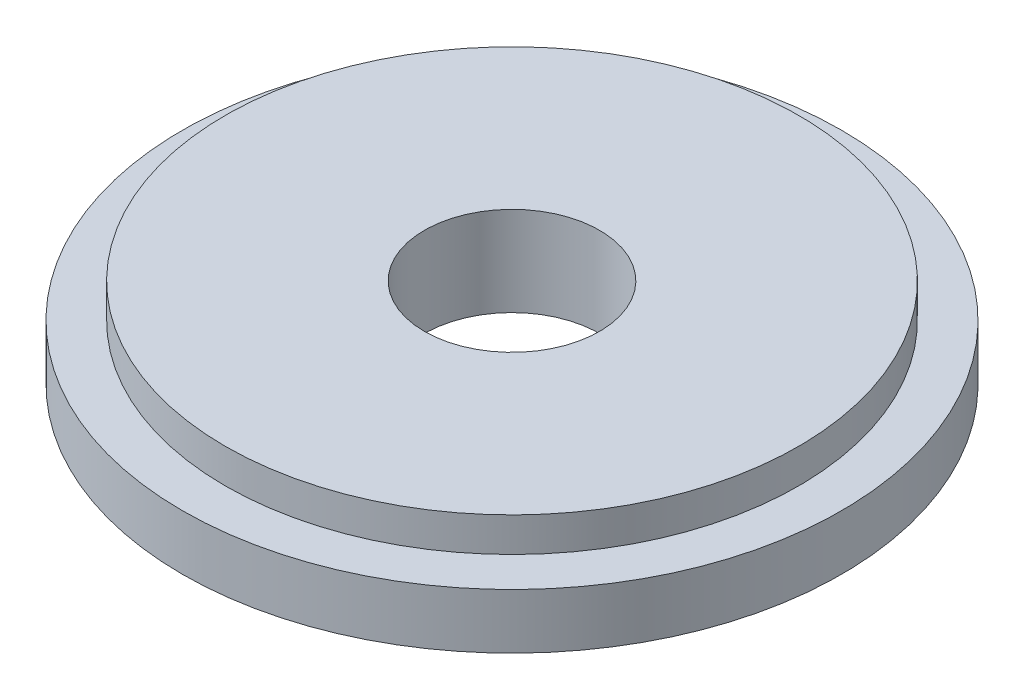
ISO-10303-21;
HEADER;
FILE_DESCRIPTION(('STEP AP214'),'2;1');
FILE_NAME('part.step','',(''),(''),'','','');
FILE_SCHEMA(('AUTOMOTIVE_DESIGN { 1 0 10303 214 1 1 1 1 }'));
ENDSEC;
DATA;
#1=APPLICATION_CONTEXT('core data for automotive mechanical design processes');
#2=APPLICATION_PROTOCOL_DEFINITION('international standard','automotive_design',2000,#1);
#3=PRODUCT_CONTEXT('',#1,'mechanical');
#4=PRODUCT('Part','Part','',(#3));
#5=PRODUCT_RELATED_PRODUCT_CATEGORY('part','',(#4));
#6=PRODUCT_DEFINITION_FORMATION('','',#4);
#7=PRODUCT_DEFINITION_CONTEXT('part definition',#1,'design');
#8=PRODUCT_DEFINITION('design','',#6,#7);
#9=PRODUCT_DEFINITION_SHAPE('','',#8);
#10=(LENGTH_UNIT() NAMED_UNIT(*) SI_UNIT(.MILLI.,.METRE.));
#11=(NAMED_UNIT(*) PLANE_ANGLE_UNIT() SI_UNIT($,.RADIAN.));
#12=(NAMED_UNIT(*) SI_UNIT($,.STERADIAN.) SOLID_ANGLE_UNIT());
#13=UNCERTAINTY_MEASURE_WITH_UNIT(LENGTH_MEASURE(1.E-05),#10,'distance_accuracy_value','');
#14=(GEOMETRIC_REPRESENTATION_CONTEXT(3) GLOBAL_UNCERTAINTY_ASSIGNED_CONTEXT((#13)) GLOBAL_UNIT_ASSIGNED_CONTEXT((#10,
#11,#12)) REPRESENTATION_CONTEXT('',''));
#15=CARTESIAN_POINT('',(0.,0.,0.));
#16=DIRECTION('',(0.,0.,1.));
#17=DIRECTION('',(1.,0.,0.));
#18=AXIS2_PLACEMENT_3D('',#15,#16,#17);
#19=CARTESIAN_POINT('',(0.,1.143,0.));
#20=DIRECTION('',(0.,1.,0.));
#21=DIRECTION('',(0.,0.,1.));
#22=AXIS2_PLACEMENT_3D('',#19,#20,#21);
#23=PLANE('',#22);
#24=CARTESIAN_POINT('',(0.,1.143,0.));
#25=DIRECTION('',(0.,1.,0.));
#26=DIRECTION('',(0.,0.,1.));
#27=AXIS2_PLACEMENT_3D('',#24,#25,#26);
#28=CIRCLE('',#27,6.8326);
#29=CARTESIAN_POINT('',(0.,1.143,6.8326));
#30=VERTEX_POINT('',#29);
#31=EDGE_CURVE('E10',#30,#30,#28,.T.);
#32=ORIENTED_EDGE('',*,*,#31,.T.);
#33=EDGE_LOOP('',(#32));
#34=FACE_BOUND('',#33,.T.);
#35=CARTESIAN_POINT('',(0.,1.143,0.));
#36=DIRECTION('',(0.,1.,0.));
#37=DIRECTION('',(0.,0.,1.));
#38=AXIS2_PLACEMENT_3D('',#35,#36,#37);
#39=CIRCLE('',#38,5.9436);
#40=CARTESIAN_POINT('',(0.,1.143,5.9436));
#41=VERTEX_POINT('',#40);
#42=EDGE_CURVE('E44',#41,#41,#39,.T.);
#43=ORIENTED_EDGE('',*,*,#42,.F.);
#44=EDGE_LOOP('',(#43));
#45=FACE_BOUND('',#44,.T.);
#46=ADVANCED_FACE('F31',(#34,#45),#23,.T.);
#47=CARTESIAN_POINT('',(0.,1.143,0.));
#48=DIRECTION('',(0.,-1.,0.));
#49=DIRECTION('',(0.,0.,-1.));
#50=AXIS2_PLACEMENT_3D('',#47,#48,#49);
#51=CYLINDRICAL_SURFACE('',#50,6.8326);
#52=ORIENTED_EDGE('',*,*,#31,.F.);
#53=EDGE_LOOP('',(#52));
#54=FACE_BOUND('',#53,.T.);
#55=CARTESIAN_POINT('',(0.,0.,0.));
#56=DIRECTION('',(0.,1.,0.));
#57=DIRECTION('',(0.,0.,1.));
#58=AXIS2_PLACEMENT_3D('',#55,#56,#57);
#59=CIRCLE('',#58,6.8326);
#60=CARTESIAN_POINT('',(0.,0.,6.8326));
#61=VERTEX_POINT('',#60);
#62=EDGE_CURVE('E35',#61,#61,#59,.T.);
#63=ORIENTED_EDGE('',*,*,#62,.T.);
#64=EDGE_LOOP('',(#63));
#65=FACE_BOUND('',#64,.T.);
#66=ADVANCED_FACE('F33',(#54,#65),#51,.T.);
#67=CARTESIAN_POINT('',(0.,0.,0.));
#68=DIRECTION('',(0.,1.,0.));
#69=DIRECTION('',(0.,0.,1.));
#70=AXIS2_PLACEMENT_3D('',#67,#68,#69);
#71=PLANE('',#70);
#72=CARTESIAN_POINT('',(0.,0.,0.));
#73=DIRECTION('',(0.,1.,0.));
#74=DIRECTION('',(0.,0.,1.));
#75=AXIS2_PLACEMENT_3D('',#72,#73,#74);
#76=CIRCLE('',#75,1.8161);
#77=CARTESIAN_POINT('',(0.,0.,1.8161));
#78=VERTEX_POINT('',#77);
#79=EDGE_CURVE('E47',#78,#78,#76,.T.);
#80=ORIENTED_EDGE('',*,*,#79,.T.);
#81=EDGE_LOOP('',(#80));
#82=FACE_BOUND('',#81,.T.);
#83=ORIENTED_EDGE('',*,*,#62,.F.);
#84=EDGE_LOOP('',(#83));
#85=FACE_BOUND('',#84,.T.);
#86=ADVANCED_FACE('F56',(#82,#85),#71,.F.);
#87=CARTESIAN_POINT('',(0.,1.8542,0.));
#88=DIRECTION('',(0.,-1.,0.));
#89=DIRECTION('',(0.,0.,-1.));
#90=AXIS2_PLACEMENT_3D('',#87,#88,#89);
#91=CYLINDRICAL_SURFACE('',#90,5.9436);
#92=CARTESIAN_POINT('',(0.,1.8542,0.));
#93=DIRECTION('',(0.,1.,0.));
#94=DIRECTION('',(0.,0.,1.));
#95=AXIS2_PLACEMENT_3D('',#92,#93,#94);
#96=CIRCLE('',#95,5.9436);
#97=CARTESIAN_POINT('',(0.,1.8542,5.9436));
#98=VERTEX_POINT('',#97);
#99=EDGE_CURVE('E42',#98,#98,#96,.T.);
#100=ORIENTED_EDGE('',*,*,#99,.F.);
#101=EDGE_LOOP('',(#100));
#102=FACE_BOUND('',#101,.T.);
#103=ORIENTED_EDGE('',*,*,#42,.T.);
#104=EDGE_LOOP('',(#103));
#105=FACE_BOUND('',#104,.T.);
#106=ADVANCED_FACE('F68',(#102,#105),#91,.T.);
#107=CARTESIAN_POINT('',(0.,1.8542,0.));
#108=DIRECTION('',(0.,1.,0.));
#109=DIRECTION('',(0.,0.,1.));
#110=AXIS2_PLACEMENT_3D('',#107,#108,#109);
#111=PLANE('',#110);
#112=CARTESIAN_POINT('',(0.,1.8542,0.));
#113=DIRECTION('',(0.,1.,0.));
#114=DIRECTION('',(0.,0.,1.));
#115=AXIS2_PLACEMENT_3D('',#112,#113,#114);
#116=CIRCLE('',#115,1.8161);
#117=CARTESIAN_POINT('',(0.,1.8542,1.8161));
#118=VERTEX_POINT('',#117);
#119=EDGE_CURVE('E50',#118,#118,#116,.T.);
#120=ORIENTED_EDGE('',*,*,#119,.F.);
#121=EDGE_LOOP('',(#120));
#122=FACE_BOUND('',#121,.T.);
#123=ORIENTED_EDGE('',*,*,#99,.T.);
#124=EDGE_LOOP('',(#123));
#125=FACE_BOUND('',#124,.T.);
#126=ADVANCED_FACE('F62',(#122,#125),#111,.T.);
#127=CARTESIAN_POINT('',(0.,0.,0.));
#128=DIRECTION('',(0.,1.,0.));
#129=DIRECTION('',(0.,0.,1.));
#130=AXIS2_PLACEMENT_3D('',#127,#128,#129);
#131=CYLINDRICAL_SURFACE('',#130,1.8161);
#132=ORIENTED_EDGE('',*,*,#79,.F.);
#133=EDGE_LOOP('',(#132));
#134=FACE_BOUND('',#133,.T.);
#135=ORIENTED_EDGE('',*,*,#119,.T.);
#136=EDGE_LOOP('',(#135));
#137=FACE_BOUND('',#136,.T.);
#138=ADVANCED_FACE('F59',(#134,#137),#131,.F.);
#139=CLOSED_SHELL('',(#46,#66,#86,#106,#126,#138));
#140=MANIFOLD_SOLID_BREP('B2',#139);
#141=ADVANCED_BREP_SHAPE_REPRESENTATION('',(#18,#140),#14);
#142=SHAPE_DEFINITION_REPRESENTATION(#9,#141);
ENDSEC;
END-ISO-10303-21;
